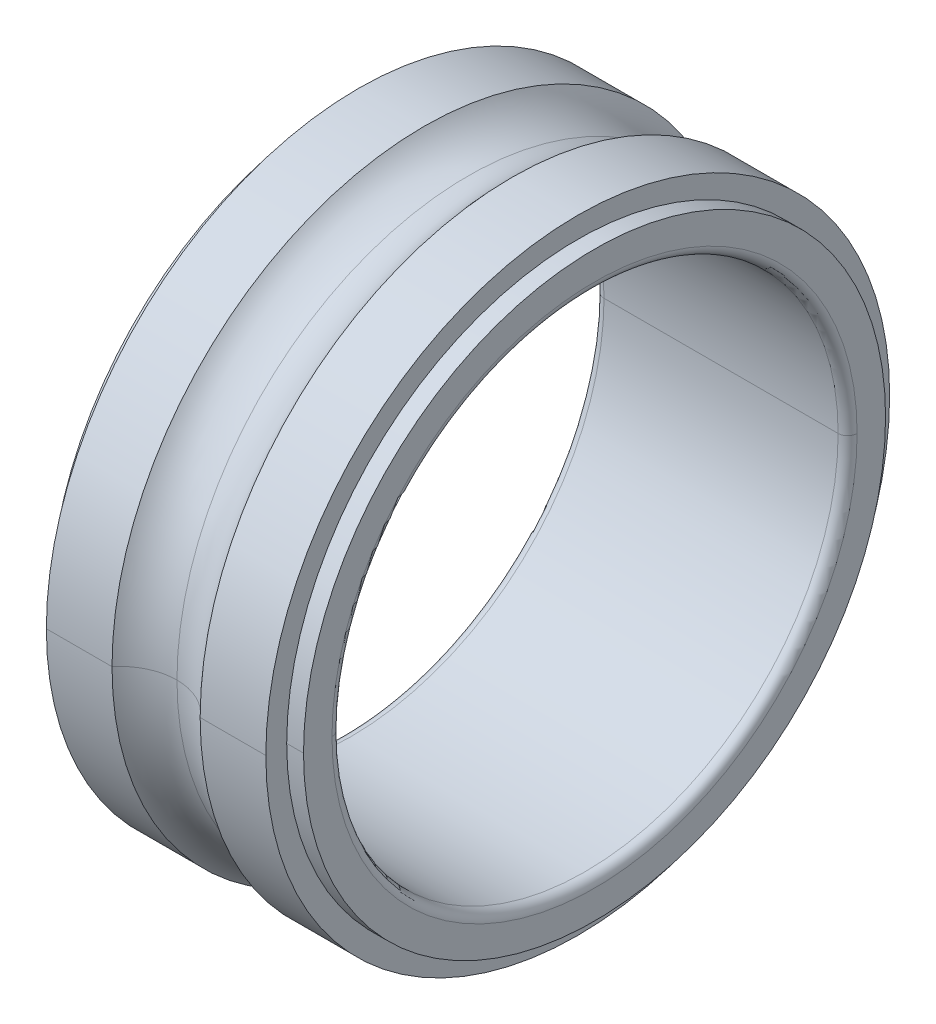
ISO-10303-21;
HEADER;
FILE_DESCRIPTION(('STEP AP214'),'2;1');
FILE_NAME('part.step','',(''),(''),'','','');
FILE_SCHEMA(('AUTOMOTIVE_DESIGN { 1 0 10303 214 1 1 1 1 }'));
ENDSEC;
DATA;
#1=APPLICATION_CONTEXT('core data for automotive mechanical design processes');
#2=APPLICATION_PROTOCOL_DEFINITION('international standard','automotive_design',2000,#1);
#3=PRODUCT_CONTEXT('',#1,'mechanical');
#4=PRODUCT('Part','Part','',(#3));
#5=PRODUCT_RELATED_PRODUCT_CATEGORY('part','',(#4));
#6=PRODUCT_DEFINITION_FORMATION('','',#4);
#7=PRODUCT_DEFINITION_CONTEXT('part definition',#1,'design');
#8=PRODUCT_DEFINITION('design','',#6,#7);
#9=PRODUCT_DEFINITION_SHAPE('','',#8);
#10=(LENGTH_UNIT() NAMED_UNIT(*) SI_UNIT(.MILLI.,.METRE.));
#11=(NAMED_UNIT(*) PLANE_ANGLE_UNIT() SI_UNIT($,.RADIAN.));
#12=(NAMED_UNIT(*) SI_UNIT($,.STERADIAN.) SOLID_ANGLE_UNIT());
#13=UNCERTAINTY_MEASURE_WITH_UNIT(LENGTH_MEASURE(1.E-05),#10,'distance_accuracy_value','');
#14=(GEOMETRIC_REPRESENTATION_CONTEXT(3) GLOBAL_UNCERTAINTY_ASSIGNED_CONTEXT((#13)) GLOBAL_UNIT_ASSIGNED_CONTEXT((#10,
#11,#12)) REPRESENTATION_CONTEXT('',''));
#15=CARTESIAN_POINT('',(0.,0.,0.));
#16=DIRECTION('',(0.,0.,1.));
#17=DIRECTION('',(1.,0.,0.));
#18=AXIS2_PLACEMENT_3D('',#15,#16,#17);
#19=CARTESIAN_POINT('',(0.,4.6,0.));
#20=DIRECTION('',(-1.,0.,0.));
#21=DIRECTION('',(0.,0.,1.));
#22=AXIS2_PLACEMENT_3D('',#19,#20,#21);
#23=PLANE('',#22);
#24=CARTESIAN_POINT('',(0.,0.,0.));
#25=DIRECTION('',(1.,0.,0.));
#26=DIRECTION('',(0.,0.,-1.));
#27=AXIS2_PLACEMENT_3D('',#24,#25,#26);
#28=CIRCLE('',#27,4.15);
#29=CARTESIAN_POINT('',(0.,0.,-4.15));
#30=VERTEX_POINT('',#29);
#31=CARTESIAN_POINT('',(0.,0.,4.15));
#32=VERTEX_POINT('',#31);
#33=EDGE_CURVE('E201',#30,#32,#28,.T.);
#34=ORIENTED_EDGE('',*,*,#33,.T.);
#35=CARTESIAN_POINT('',(0.,0.,0.));
#36=DIRECTION('',(1.,0.,0.));
#37=DIRECTION('',(0.,0.,-1.));
#38=AXIS2_PLACEMENT_3D('',#35,#36,#37);
#39=CIRCLE('',#38,4.15);
#40=EDGE_CURVE('E11',#32,#30,#39,.T.);
#41=ORIENTED_EDGE('',*,*,#40,.T.);
#42=EDGE_LOOP('',(#34,#41));
#43=FACE_BOUND('',#42,.T.);
#44=CARTESIAN_POINT('',(0.,0.,0.));
#45=DIRECTION('',(1.,0.,0.));
#46=DIRECTION('',(0.,0.,-1.));
#47=AXIS2_PLACEMENT_3D('',#44,#45,#46);
#48=CIRCLE('',#47,4.6);
#49=CARTESIAN_POINT('',(0.,0.,-4.6));
#50=VERTEX_POINT('',#49);
#51=CARTESIAN_POINT('',(0.,0.,4.6));
#52=VERTEX_POINT('',#51);
#53=EDGE_CURVE('E42',#50,#52,#48,.T.);
#54=ORIENTED_EDGE('',*,*,#53,.F.);
#55=CARTESIAN_POINT('',(0.,0.,0.));
#56=DIRECTION('',(1.,0.,0.));
#57=DIRECTION('',(0.,0.,-1.));
#58=AXIS2_PLACEMENT_3D('',#55,#56,#57);
#59=CIRCLE('',#58,4.6);
#60=EDGE_CURVE('E273',#52,#50,#59,.T.);
#61=ORIENTED_EDGE('',*,*,#60,.F.);
#62=EDGE_LOOP('',(#54,#61));
#63=FACE_BOUND('',#62,.T.);
#64=ADVANCED_FACE('F17',(#43,#63),#23,.T.);
#65=CARTESIAN_POINT('',(0.15,0.,0.));
#66=DIRECTION('',(1.,0.,0.));
#67=DIRECTION('',(0.,0.,-1.));
#68=AXIS2_PLACEMENT_3D('',#65,#66,#67);
#69=TOROIDAL_SURFACE('',#68,4.15,0.15);
#70=CARTESIAN_POINT('',(0.15,0.,4.15));
#71=DIRECTION('',(0.,1.,0.));
#72=DIRECTION('',(0.,0.,1.));
#73=AXIS2_PLACEMENT_3D('',#70,#71,#72);
#74=CIRCLE('',#73,0.15);
#75=CARTESIAN_POINT('',(0.15,0.,4.));
#76=VERTEX_POINT('',#75);
#77=EDGE_CURVE('E197',#76,#32,#74,.T.);
#78=ORIENTED_EDGE('',*,*,#77,.F.);
#79=CARTESIAN_POINT('',(0.15,0.,0.));
#80=DIRECTION('',(1.,0.,0.));
#81=DIRECTION('',(0.,0.,-1.));
#82=AXIS2_PLACEMENT_3D('',#79,#80,#81);
#83=CIRCLE('',#82,4.);
#84=CARTESIAN_POINT('',(0.15,0.,-4.));
#85=VERTEX_POINT('',#84);
#86=EDGE_CURVE('E28',#76,#85,#83,.T.);
#87=ORIENTED_EDGE('',*,*,#86,.T.);
#88=CARTESIAN_POINT('',(0.15,0.,-4.15));
#89=DIRECTION('',(0.,-1.,0.));
#90=DIRECTION('',(0.,0.,-1.));
#91=AXIS2_PLACEMENT_3D('',#88,#89,#90);
#92=CIRCLE('',#91,0.15);
#93=EDGE_CURVE('E264',#85,#30,#92,.T.);
#94=ORIENTED_EDGE('',*,*,#93,.T.);
#95=ORIENTED_EDGE('',*,*,#40,.F.);
#96=EDGE_LOOP('',(#78,#87,#94,#95));
#97=FACE_BOUND('',#96,.T.);
#98=ADVANCED_FACE('F356',(#97),#69,.T.);
#99=CARTESIAN_POINT('',(4.,0.,0.));
#100=DIRECTION('',(-1.,0.,0.));
#101=DIRECTION('',(0.,0.,-1.));
#102=AXIS2_PLACEMENT_3D('',#99,#100,#101);
#103=CYLINDRICAL_SURFACE('',#102,4.);
#104=DIRECTION('',(-1.,0.,0.));
#105=VECTOR('',#104,1.);
#106=CARTESIAN_POINT('',(4.,0.,4.));
#107=LINE('',#106,#105);
#108=CARTESIAN_POINT('',(3.85,0.,4.));
#109=VERTEX_POINT('',#108);
#110=EDGE_CURVE('E232',#109,#76,#107,.T.);
#111=ORIENTED_EDGE('',*,*,#110,.F.);
#112=CARTESIAN_POINT('',(3.85,0.,0.));
#113=DIRECTION('',(1.,0.,0.));
#114=DIRECTION('',(0.,0.,-1.));
#115=AXIS2_PLACEMENT_3D('',#112,#113,#114);
#116=CIRCLE('',#115,4.);
#117=CARTESIAN_POINT('',(3.85,0.,-4.));
#118=VERTEX_POINT('',#117);
#119=EDGE_CURVE('E243',#109,#118,#116,.T.);
#120=ORIENTED_EDGE('',*,*,#119,.T.);
#121=DIRECTION('',(-1.,0.,0.));
#122=VECTOR('',#121,1.);
#123=CARTESIAN_POINT('',(4.,0.,-4.));
#124=LINE('',#123,#122);
#125=EDGE_CURVE('E228',#118,#85,#124,.T.);
#126=ORIENTED_EDGE('',*,*,#125,.T.);
#127=ORIENTED_EDGE('',*,*,#86,.F.);
#128=EDGE_LOOP('',(#111,#120,#126,#127));
#129=FACE_BOUND('',#128,.T.);
#130=ADVANCED_FACE('F19',(#129),#103,.F.);
#131=CARTESIAN_POINT('',(3.85,0.,0.));
#132=DIRECTION('',(1.,0.,0.));
#133=DIRECTION('',(0.,0.,-1.));
#134=AXIS2_PLACEMENT_3D('',#131,#132,#133);
#135=TOROIDAL_SURFACE('',#134,4.15,0.15);
#136=CARTESIAN_POINT('',(3.85,0.,4.15));
#137=DIRECTION('',(0.,1.,0.));
#138=DIRECTION('',(0.,0.,1.));
#139=AXIS2_PLACEMENT_3D('',#136,#137,#138);
#140=CIRCLE('',#139,0.15);
#141=CARTESIAN_POINT('',(4.,0.,4.15));
#142=VERTEX_POINT('',#141);
#143=EDGE_CURVE('E248',#142,#109,#140,.T.);
#144=ORIENTED_EDGE('',*,*,#143,.F.);
#145=CARTESIAN_POINT('',(4.,0.,0.));
#146=DIRECTION('',(1.,0.,0.));
#147=DIRECTION('',(0.,0.,-1.));
#148=AXIS2_PLACEMENT_3D('',#145,#146,#147);
#149=CIRCLE('',#148,4.15);
#150=CARTESIAN_POINT('',(4.,0.,-4.15));
#151=VERTEX_POINT('',#150);
#152=EDGE_CURVE('E269',#142,#151,#149,.T.);
#153=ORIENTED_EDGE('',*,*,#152,.T.);
#154=CARTESIAN_POINT('',(3.85,0.,-4.15));
#155=DIRECTION('',(0.,-1.,0.));
#156=DIRECTION('',(0.,0.,-1.));
#157=AXIS2_PLACEMENT_3D('',#154,#155,#156);
#158=CIRCLE('',#157,0.15);
#159=EDGE_CURVE('E205',#151,#118,#158,.T.);
#160=ORIENTED_EDGE('',*,*,#159,.T.);
#161=ORIENTED_EDGE('',*,*,#119,.F.);
#162=EDGE_LOOP('',(#144,#153,#160,#161));
#163=FACE_BOUND('',#162,.T.);
#164=ADVANCED_FACE('F365',(#163),#135,.T.);
#165=CARTESIAN_POINT('',(4.,4.15,0.));
#166=DIRECTION('',(1.,0.,0.));
#167=DIRECTION('',(0.,1.,0.));
#168=AXIS2_PLACEMENT_3D('',#165,#166,#167);
#169=PLANE('',#168);
#170=CARTESIAN_POINT('',(4.,0.,0.));
#171=DIRECTION('',(1.,0.,0.));
#172=DIRECTION('',(0.,0.,-1.));
#173=AXIS2_PLACEMENT_3D('',#170,#171,#172);
#174=CIRCLE('',#173,4.15);
#175=EDGE_CURVE('E231',#151,#142,#174,.T.);
#176=ORIENTED_EDGE('',*,*,#175,.F.);
#177=ORIENTED_EDGE('',*,*,#152,.F.);
#178=EDGE_LOOP('',(#176,#177));
#179=FACE_BOUND('',#178,.T.);
#180=CARTESIAN_POINT('',(4.,0.,0.));
#181=DIRECTION('',(1.,0.,0.));
#182=DIRECTION('',(0.,0.,-1.));
#183=AXIS2_PLACEMENT_3D('',#180,#181,#182);
#184=CIRCLE('',#183,4.6);
#185=CARTESIAN_POINT('',(4.,0.,-4.6));
#186=VERTEX_POINT('',#185);
#187=CARTESIAN_POINT('',(4.,0.,4.6));
#188=VERTEX_POINT('',#187);
#189=EDGE_CURVE('E160',#186,#188,#184,.T.);
#190=ORIENTED_EDGE('',*,*,#189,.T.);
#191=CARTESIAN_POINT('',(4.,0.,0.));
#192=DIRECTION('',(1.,0.,0.));
#193=DIRECTION('',(0.,0.,-1.));
#194=AXIS2_PLACEMENT_3D('',#191,#192,#193);
#195=CIRCLE('',#194,4.6);
#196=EDGE_CURVE('E178',#188,#186,#195,.T.);
#197=ORIENTED_EDGE('',*,*,#196,.T.);
#198=EDGE_LOOP('',(#190,#197));
#199=FACE_BOUND('',#198,.T.);
#200=ADVANCED_FACE('F351',(#179,#199),#169,.T.);
#201=CARTESIAN_POINT('',(4.,0.,0.));
#202=DIRECTION('',(-1.,0.,0.));
#203=DIRECTION('',(0.,0.,-1.));
#204=AXIS2_PLACEMENT_3D('',#201,#202,#203);
#205=CYLINDRICAL_SURFACE('',#204,4.6);
#206=DIRECTION('',(-1.,0.,0.));
#207=VECTOR('',#206,1.);
#208=CARTESIAN_POINT('',(4.,0.,4.6));
#209=LINE('',#208,#207);
#210=CARTESIAN_POINT('',(3.7344,0.,4.6));
#211=VERTEX_POINT('',#210);
#212=EDGE_CURVE('E171',#188,#211,#209,.T.);
#213=ORIENTED_EDGE('',*,*,#212,.F.);
#214=ORIENTED_EDGE('',*,*,#189,.F.);
#215=DIRECTION('',(-1.,0.,0.));
#216=VECTOR('',#215,1.);
#217=CARTESIAN_POINT('',(4.,0.,-4.6));
#218=LINE('',#217,#216);
#219=CARTESIAN_POINT('',(3.7344,0.,-4.6));
#220=VERTEX_POINT('',#219);
#221=EDGE_CURVE('E21',#186,#220,#218,.T.);
#222=ORIENTED_EDGE('',*,*,#221,.T.);
#223=CARTESIAN_POINT('',(3.7344,0.,0.));
#224=DIRECTION('',(1.,0.,0.));
#225=DIRECTION('',(0.,0.,-1.));
#226=AXIS2_PLACEMENT_3D('',#223,#224,#225);
#227=CIRCLE('',#226,4.6);
#228=EDGE_CURVE('E150',#220,#211,#227,.T.);
#229=ORIENTED_EDGE('',*,*,#228,.T.);
#230=EDGE_LOOP('',(#213,#214,#222,#229));
#231=FACE_BOUND('',#230,.T.);
#232=ADVANCED_FACE('F164',(#231),#205,.T.);
#233=CARTESIAN_POINT('',(3.7344,4.6,0.));
#234=DIRECTION('',(1.,0.,0.));
#235=DIRECTION('',(0.,1.,0.));
#236=AXIS2_PLACEMENT_3D('',#233,#234,#235);
#237=PLANE('',#236);
#238=ORIENTED_EDGE('',*,*,#228,.F.);
#239=CARTESIAN_POINT('',(3.7344,0.,0.));
#240=DIRECTION('',(1.,0.,0.));
#241=DIRECTION('',(0.,0.,-1.));
#242=AXIS2_PLACEMENT_3D('',#239,#240,#241);
#243=CIRCLE('',#242,4.6);
#244=EDGE_CURVE('E155',#211,#220,#243,.T.);
#245=ORIENTED_EDGE('',*,*,#244,.F.);
#246=EDGE_LOOP('',(#238,#245));
#247=FACE_BOUND('',#246,.T.);
#248=CARTESIAN_POINT('',(3.7344,0.,0.));
#249=DIRECTION('',(1.,0.,0.));
#250=DIRECTION('',(0.,0.,-1.));
#251=AXIS2_PLACEMENT_3D('',#248,#249,#250);
#252=CIRCLE('',#251,4.93);
#253=CARTESIAN_POINT('',(3.7344,0.,-4.93));
#254=VERTEX_POINT('',#253);
#255=CARTESIAN_POINT('',(3.7344,0.,4.93));
#256=VERTEX_POINT('',#255);
#257=EDGE_CURVE('E161',#254,#256,#252,.T.);
#258=ORIENTED_EDGE('',*,*,#257,.T.);
#259=CARTESIAN_POINT('',(3.7344,0.,0.));
#260=DIRECTION('',(1.,0.,0.));
#261=DIRECTION('',(0.,0.,-1.));
#262=AXIS2_PLACEMENT_3D('',#259,#260,#261);
#263=CIRCLE('',#262,4.93);
#264=EDGE_CURVE('E169',#256,#254,#263,.T.);
#265=ORIENTED_EDGE('',*,*,#264,.T.);
#266=EDGE_LOOP('',(#258,#265));
#267=FACE_BOUND('',#266,.T.);
#268=ADVANCED_FACE('F152',(#247,#267),#237,.T.);
#269=CARTESIAN_POINT('',(4.,0.,0.));
#270=DIRECTION('',(-1.,0.,0.));
#271=DIRECTION('',(0.,0.,-1.));
#272=AXIS2_PLACEMENT_3D('',#269,#270,#271);
#273=CYLINDRICAL_SURFACE('',#272,4.93);
#274=DIRECTION('',(-1.,0.,0.));
#275=VECTOR('',#274,1.);
#276=CARTESIAN_POINT('',(4.,0.,4.93));
#277=LINE('',#276,#275);
#278=CARTESIAN_POINT('',(2.69649120597463,0.,4.93));
#279=VERTEX_POINT('',#278);
#280=EDGE_CURVE('E255',#256,#279,#277,.T.);
#281=ORIENTED_EDGE('',*,*,#280,.F.);
#282=ORIENTED_EDGE('',*,*,#257,.F.);
#283=DIRECTION('',(-1.,0.,0.));
#284=VECTOR('',#283,1.);
#285=CARTESIAN_POINT('',(4.,0.,-4.93));
#286=LINE('',#285,#284);
#287=CARTESIAN_POINT('',(2.69649120597463,0.,-4.93));
#288=VERTEX_POINT('',#287);
#289=EDGE_CURVE('E211',#254,#288,#286,.T.);
#290=ORIENTED_EDGE('',*,*,#289,.T.);
#291=CARTESIAN_POINT('',(2.69649120597463,0.,0.));
#292=DIRECTION('',(1.,0.,0.));
#293=DIRECTION('',(0.,0.,-1.));
#294=AXIS2_PLACEMENT_3D('',#291,#292,#293);
#295=CIRCLE('',#294,4.93);
#296=EDGE_CURVE('E184',#288,#279,#295,.T.);
#297=ORIENTED_EDGE('',*,*,#296,.T.);
#298=EDGE_LOOP('',(#281,#282,#290,#297));
#299=FACE_BOUND('',#298,.T.);
#300=ADVANCED_FACE('F340',(#299),#273,.T.);
#301=CARTESIAN_POINT('',(2.,0.,0.));
#302=DIRECTION('',(1.,0.,0.));
#303=DIRECTION('',(0.,0.,-1.));
#304=AXIS2_PLACEMENT_3D('',#301,#302,#303);
#305=TOROIDAL_SURFACE('',#304,5.5,0.9);
#306=CARTESIAN_POINT('',(2.,0.,0.));
#307=DIRECTION('',(1.,0.,0.));
#308=DIRECTION('',(0.,0.,-1.));
#309=AXIS2_PLACEMENT_3D('',#306,#307,#308);
#310=CIRCLE('',#309,4.6);
#311=CARTESIAN_POINT('',(2.,0.,-4.6));
#312=VERTEX_POINT('',#311);
#313=CARTESIAN_POINT('',(2.,0.,4.6));
#314=VERTEX_POINT('',#313);
#315=EDGE_CURVE('E185',#312,#314,#310,.T.);
#316=ORIENTED_EDGE('',*,*,#315,.F.);
#317=CARTESIAN_POINT('',(2.,0.,-5.5));
#318=DIRECTION('',(0.,-1.,0.));
#319=DIRECTION('',(0.,0.,-1.));
#320=AXIS2_PLACEMENT_3D('',#317,#318,#319);
#321=CIRCLE('',#320,0.9);
#322=CARTESIAN_POINT('',(1.30350879402537,0.,-4.93));
#323=VERTEX_POINT('',#322);
#324=EDGE_CURVE('E196',#312,#323,#321,.T.);
#325=ORIENTED_EDGE('',*,*,#324,.T.);
#326=CARTESIAN_POINT('',(1.30350879402537,0.,0.));
#327=DIRECTION('',(1.,0.,0.));
#328=DIRECTION('',(0.,0.,-1.));
#329=AXIS2_PLACEMENT_3D('',#326,#327,#328);
#330=CIRCLE('',#329,4.93);
#331=CARTESIAN_POINT('',(1.30350879402537,0.,4.93));
#332=VERTEX_POINT('',#331);
#333=EDGE_CURVE('E214',#323,#332,#330,.T.);
#334=ORIENTED_EDGE('',*,*,#333,.T.);
#335=CARTESIAN_POINT('',(2.,0.,5.5));
#336=DIRECTION('',(0.,1.,0.));
#337=DIRECTION('',(0.,0.,1.));
#338=AXIS2_PLACEMENT_3D('',#335,#336,#337);
#339=CIRCLE('',#338,0.9);
#340=EDGE_CURVE('E206',#314,#332,#339,.T.);
#341=ORIENTED_EDGE('',*,*,#340,.F.);
#342=EDGE_LOOP('',(#316,#325,#334,#341));
#343=FACE_BOUND('',#342,.T.);
#344=ADVANCED_FACE('F327',(#343),#305,.F.);
#345=CARTESIAN_POINT('',(4.,0.,0.));
#346=DIRECTION('',(-1.,0.,0.));
#347=DIRECTION('',(0.,0.,-1.));
#348=AXIS2_PLACEMENT_3D('',#345,#346,#347);
#349=CYLINDRICAL_SURFACE('',#348,4.93);
#350=DIRECTION('',(-1.,0.,0.));
#351=VECTOR('',#350,1.);
#352=CARTESIAN_POINT('',(4.,0.,4.93));
#353=LINE('',#352,#351);
#354=CARTESIAN_POINT('',(0.2656,0.,4.93));
#355=VERTEX_POINT('',#354);
#356=EDGE_CURVE('E191',#332,#355,#353,.T.);
#357=ORIENTED_EDGE('',*,*,#356,.F.);
#358=ORIENTED_EDGE('',*,*,#333,.F.);
#359=DIRECTION('',(-1.,0.,0.));
#360=VECTOR('',#359,1.);
#361=CARTESIAN_POINT('',(4.,0.,-4.93));
#362=LINE('',#361,#360);
#363=CARTESIAN_POINT('',(0.2656,0.,-4.93));
#364=VERTEX_POINT('',#363);
#365=EDGE_CURVE('E236',#323,#364,#362,.T.);
#366=ORIENTED_EDGE('',*,*,#365,.T.);
#367=CARTESIAN_POINT('',(0.2656,0.,0.));
#368=DIRECTION('',(1.,0.,0.));
#369=DIRECTION('',(0.,0.,-1.));
#370=AXIS2_PLACEMENT_3D('',#367,#368,#369);
#371=CIRCLE('',#370,4.93);
#372=EDGE_CURVE('E217',#364,#355,#371,.T.);
#373=ORIENTED_EDGE('',*,*,#372,.T.);
#374=EDGE_LOOP('',(#357,#358,#366,#373));
#375=FACE_BOUND('',#374,.T.);
#376=ADVANCED_FACE('F386',(#375),#349,.T.);
#377=CARTESIAN_POINT('',(0.2656,4.93,0.));
#378=DIRECTION('',(-1.,0.,0.));
#379=DIRECTION('',(0.,0.,1.));
#380=AXIS2_PLACEMENT_3D('',#377,#378,#379);
#381=PLANE('',#380);
#382=CARTESIAN_POINT('',(0.2656,0.,0.));
#383=DIRECTION('',(1.,0.,0.));
#384=DIRECTION('',(0.,0.,-1.));
#385=AXIS2_PLACEMENT_3D('',#382,#383,#384);
#386=CIRCLE('',#385,4.6);
#387=CARTESIAN_POINT('',(0.2656,0.,-4.6));
#388=VERTEX_POINT('',#387);
#389=CARTESIAN_POINT('',(0.2656,0.,4.6));
#390=VERTEX_POINT('',#389);
#391=EDGE_CURVE('E258',#388,#390,#386,.T.);
#392=ORIENTED_EDGE('',*,*,#391,.T.);
#393=CARTESIAN_POINT('',(0.2656,0.,0.));
#394=DIRECTION('',(1.,0.,0.));
#395=DIRECTION('',(0.,0.,-1.));
#396=AXIS2_PLACEMENT_3D('',#393,#394,#395);
#397=CIRCLE('',#396,4.6);
#398=EDGE_CURVE('E237',#390,#388,#397,.T.);
#399=ORIENTED_EDGE('',*,*,#398,.T.);
#400=EDGE_LOOP('',(#392,#399));
#401=FACE_BOUND('',#400,.T.);
#402=ORIENTED_EDGE('',*,*,#372,.F.);
#403=CARTESIAN_POINT('',(0.2656,0.,0.));
#404=DIRECTION('',(1.,0.,0.));
#405=DIRECTION('',(0.,0.,-1.));
#406=AXIS2_PLACEMENT_3D('',#403,#404,#405);
#407=CIRCLE('',#406,4.93);
#408=EDGE_CURVE('E195',#355,#364,#407,.T.);
#409=ORIENTED_EDGE('',*,*,#408,.F.);
#410=EDGE_LOOP('',(#402,#409));
#411=FACE_BOUND('',#410,.T.);
#412=ADVANCED_FACE('F380',(#401,#411),#381,.T.);
#413=CARTESIAN_POINT('',(4.,0.,0.));
#414=DIRECTION('',(-1.,0.,0.));
#415=DIRECTION('',(0.,0.,-1.));
#416=AXIS2_PLACEMENT_3D('',#413,#414,#415);
#417=CYLINDRICAL_SURFACE('',#416,4.6);
#418=DIRECTION('',(-1.,0.,0.));
#419=VECTOR('',#418,1.);
#420=CARTESIAN_POINT('',(4.,0.,4.6));
#421=LINE('',#420,#419);
#422=EDGE_CURVE('E240',#390,#52,#421,.T.);
#423=ORIENTED_EDGE('',*,*,#422,.F.);
#424=ORIENTED_EDGE('',*,*,#391,.F.);
#425=DIRECTION('',(-1.,0.,0.));
#426=VECTOR('',#425,1.);
#427=CARTESIAN_POINT('',(4.,0.,-4.6));
#428=LINE('',#427,#426);
#429=EDGE_CURVE('E283',#388,#50,#428,.T.);
#430=ORIENTED_EDGE('',*,*,#429,.T.);
#431=ORIENTED_EDGE('',*,*,#53,.T.);
#432=EDGE_LOOP('',(#423,#424,#430,#431));
#433=FACE_BOUND('',#432,.T.);
#434=ADVANCED_FACE('F377',(#433),#417,.T.);
#435=CARTESIAN_POINT('',(4.,0.,0.));
#436=DIRECTION('',(-1.,0.,0.));
#437=DIRECTION('',(0.,0.,-1.));
#438=AXIS2_PLACEMENT_3D('',#435,#436,#437);
#439=CYLINDRICAL_SURFACE('',#438,4.6);
#440=ORIENTED_EDGE('',*,*,#398,.F.);
#441=ORIENTED_EDGE('',*,*,#422,.T.);
#442=ORIENTED_EDGE('',*,*,#60,.T.);
#443=ORIENTED_EDGE('',*,*,#429,.F.);
#444=EDGE_LOOP('',(#440,#441,#442,#443));
#445=FACE_BOUND('',#444,.T.);
#446=ADVANCED_FACE('F379',(#445),#439,.T.);
#447=CARTESIAN_POINT('',(4.,0.,0.));
#448=DIRECTION('',(-1.,0.,0.));
#449=DIRECTION('',(0.,0.,-1.));
#450=AXIS2_PLACEMENT_3D('',#447,#448,#449);
#451=CYLINDRICAL_SURFACE('',#450,4.93);
#452=CARTESIAN_POINT('',(1.30350879402537,0.,0.));
#453=DIRECTION('',(1.,0.,0.));
#454=DIRECTION('',(0.,0.,-1.));
#455=AXIS2_PLACEMENT_3D('',#452,#453,#454);
#456=CIRCLE('',#455,4.93);
#457=EDGE_CURVE('E210',#332,#323,#456,.T.);
#458=ORIENTED_EDGE('',*,*,#457,.F.);
#459=ORIENTED_EDGE('',*,*,#356,.T.);
#460=ORIENTED_EDGE('',*,*,#408,.T.);
#461=ORIENTED_EDGE('',*,*,#365,.F.);
#462=EDGE_LOOP('',(#458,#459,#460,#461));
#463=FACE_BOUND('',#462,.T.);
#464=ADVANCED_FACE('F321',(#463),#451,.T.);
#465=CARTESIAN_POINT('',(2.,0.,0.));
#466=DIRECTION('',(1.,0.,0.));
#467=DIRECTION('',(0.,0.,-1.));
#468=AXIS2_PLACEMENT_3D('',#465,#466,#467);
#469=TOROIDAL_SURFACE('',#468,5.5,0.9);
#470=CARTESIAN_POINT('',(2.,0.,0.));
#471=DIRECTION('',(1.,0.,0.));
#472=DIRECTION('',(0.,0.,-1.));
#473=AXIS2_PLACEMENT_3D('',#470,#471,#472);
#474=CIRCLE('',#473,4.6);
#475=EDGE_CURVE('E186',#314,#312,#474,.T.);
#476=ORIENTED_EDGE('',*,*,#475,.F.);
#477=ORIENTED_EDGE('',*,*,#340,.T.);
#478=ORIENTED_EDGE('',*,*,#457,.T.);
#479=ORIENTED_EDGE('',*,*,#324,.F.);
#480=EDGE_LOOP('',(#476,#477,#478,#479));
#481=FACE_BOUND('',#480,.T.);
#482=ADVANCED_FACE('F318',(#481),#469,.F.);
#483=CARTESIAN_POINT('',(4.,0.,0.));
#484=DIRECTION('',(-1.,0.,0.));
#485=DIRECTION('',(0.,0.,-1.));
#486=AXIS2_PLACEMENT_3D('',#483,#484,#485);
#487=CYLINDRICAL_SURFACE('',#486,4.93);
#488=ORIENTED_EDGE('',*,*,#264,.F.);
#489=ORIENTED_EDGE('',*,*,#280,.T.);
#490=CARTESIAN_POINT('',(2.69649120597463,0.,0.));
#491=DIRECTION('',(1.,0.,0.));
#492=DIRECTION('',(0.,0.,-1.));
#493=AXIS2_PLACEMENT_3D('',#490,#491,#492);
#494=CIRCLE('',#493,4.93);
#495=EDGE_CURVE('E190',#279,#288,#494,.T.);
#496=ORIENTED_EDGE('',*,*,#495,.T.);
#497=ORIENTED_EDGE('',*,*,#289,.F.);
#498=EDGE_LOOP('',(#488,#489,#496,#497));
#499=FACE_BOUND('',#498,.T.);
#500=ADVANCED_FACE('F342',(#499),#487,.T.);
#501=CARTESIAN_POINT('',(4.,0.,0.));
#502=DIRECTION('',(-1.,0.,0.));
#503=DIRECTION('',(0.,0.,-1.));
#504=AXIS2_PLACEMENT_3D('',#501,#502,#503);
#505=CYLINDRICAL_SURFACE('',#504,4.6);
#506=ORIENTED_EDGE('',*,*,#196,.F.);
#507=ORIENTED_EDGE('',*,*,#212,.T.);
#508=ORIENTED_EDGE('',*,*,#244,.T.);
#509=ORIENTED_EDGE('',*,*,#221,.F.);
#510=EDGE_LOOP('',(#506,#507,#508,#509));
#511=FACE_BOUND('',#510,.T.);
#512=ADVANCED_FACE('F170',(#511),#505,.T.);
#513=CARTESIAN_POINT('',(3.85,0.,0.));
#514=DIRECTION('',(1.,0.,0.));
#515=DIRECTION('',(0.,0.,-1.));
#516=AXIS2_PLACEMENT_3D('',#513,#514,#515);
#517=TOROIDAL_SURFACE('',#516,4.15,0.15);
#518=ORIENTED_EDGE('',*,*,#175,.T.);
#519=ORIENTED_EDGE('',*,*,#143,.T.);
#520=CARTESIAN_POINT('',(3.85,0.,0.));
#521=DIRECTION('',(1.,0.,0.));
#522=DIRECTION('',(0.,0.,-1.));
#523=AXIS2_PLACEMENT_3D('',#520,#521,#522);
#524=CIRCLE('',#523,4.);
#525=EDGE_CURVE('E251',#118,#109,#524,.T.);
#526=ORIENTED_EDGE('',*,*,#525,.F.);
#527=ORIENTED_EDGE('',*,*,#159,.F.);
#528=EDGE_LOOP('',(#518,#519,#526,#527));
#529=FACE_BOUND('',#528,.T.);
#530=ADVANCED_FACE('F376',(#529),#517,.T.);
#531=CARTESIAN_POINT('',(4.,0.,0.));
#532=DIRECTION('',(-1.,0.,0.));
#533=DIRECTION('',(0.,0.,-1.));
#534=AXIS2_PLACEMENT_3D('',#531,#532,#533);
#535=CYLINDRICAL_SURFACE('',#534,4.);
#536=ORIENTED_EDGE('',*,*,#525,.T.);
#537=ORIENTED_EDGE('',*,*,#110,.T.);
#538=CARTESIAN_POINT('',(0.15,0.,0.));
#539=DIRECTION('',(1.,0.,0.));
#540=DIRECTION('',(0.,0.,-1.));
#541=AXIS2_PLACEMENT_3D('',#538,#539,#540);
#542=CIRCLE('',#541,4.);
#543=EDGE_CURVE('E202',#85,#76,#542,.T.);
#544=ORIENTED_EDGE('',*,*,#543,.F.);
#545=ORIENTED_EDGE('',*,*,#125,.F.);
#546=EDGE_LOOP('',(#536,#537,#544,#545));
#547=FACE_BOUND('',#546,.T.);
#548=ADVANCED_FACE('F370',(#547),#535,.F.);
#549=CARTESIAN_POINT('',(0.15,0.,0.));
#550=DIRECTION('',(1.,0.,0.));
#551=DIRECTION('',(0.,0.,-1.));
#552=AXIS2_PLACEMENT_3D('',#549,#550,#551);
#553=TOROIDAL_SURFACE('',#552,4.15,0.15);
#554=ORIENTED_EDGE('',*,*,#543,.T.);
#555=ORIENTED_EDGE('',*,*,#77,.T.);
#556=ORIENTED_EDGE('',*,*,#33,.F.);
#557=ORIENTED_EDGE('',*,*,#93,.F.);
#558=EDGE_LOOP('',(#554,#555,#556,#557));
#559=FACE_BOUND('',#558,.T.);
#560=ADVANCED_FACE('F367',(#559),#553,.T.);
#561=CARTESIAN_POINT('',(2.,0.,0.));
#562=DIRECTION('',(1.,0.,0.));
#563=DIRECTION('',(0.,0.,-1.));
#564=AXIS2_PLACEMENT_3D('',#561,#562,#563);
#565=TOROIDAL_SURFACE('',#564,5.5,0.9);
#566=CARTESIAN_POINT('',(2.,0.,5.5));
#567=DIRECTION('',(0.,1.,0.));
#568=DIRECTION('',(0.,0.,1.));
#569=AXIS2_PLACEMENT_3D('',#566,#567,#568);
#570=CIRCLE('',#569,0.9);
#571=EDGE_CURVE('E181',#279,#314,#570,.T.);
#572=ORIENTED_EDGE('',*,*,#571,.T.);
#573=ORIENTED_EDGE('',*,*,#475,.T.);
#574=CARTESIAN_POINT('',(2.,0.,-5.5));
#575=DIRECTION('',(0.,-1.,0.));
#576=DIRECTION('',(0.,0.,-1.));
#577=AXIS2_PLACEMENT_3D('',#574,#575,#576);
#578=CIRCLE('',#577,0.9);
#579=EDGE_CURVE('E221',#288,#312,#578,.T.);
#580=ORIENTED_EDGE('',*,*,#579,.F.);
#581=ORIENTED_EDGE('',*,*,#495,.F.);
#582=EDGE_LOOP('',(#572,#573,#580,#581));
#583=FACE_BOUND('',#582,.T.);
#584=ADVANCED_FACE('F335',(#583),#565,.F.);
#585=CARTESIAN_POINT('',(2.,0.,0.));
#586=DIRECTION('',(1.,0.,0.));
#587=DIRECTION('',(0.,0.,-1.));
#588=AXIS2_PLACEMENT_3D('',#585,#586,#587);
#589=TOROIDAL_SURFACE('',#588,5.5,0.9);
#590=ORIENTED_EDGE('',*,*,#579,.T.);
#591=ORIENTED_EDGE('',*,*,#315,.T.);
#592=ORIENTED_EDGE('',*,*,#571,.F.);
#593=ORIENTED_EDGE('',*,*,#296,.F.);
#594=EDGE_LOOP('',(#590,#591,#592,#593));
#595=FACE_BOUND('',#594,.T.);
#596=ADVANCED_FACE('F332',(#595),#589,.F.);
#597=CLOSED_SHELL('',(#64,#98,#130,#164,#200,#232,#268,#300,#344,#376,#412,#434,#446,#464,#482,
#500,#512,#530,#548,#560,#584,#596));
#598=MANIFOLD_SOLID_BREP('B1',#597);
#599=ADVANCED_BREP_SHAPE_REPRESENTATION('',(#18,#598),#14);
#600=SHAPE_DEFINITION_REPRESENTATION(#9,#599);
ENDSEC;
END-ISO-10303-21;
